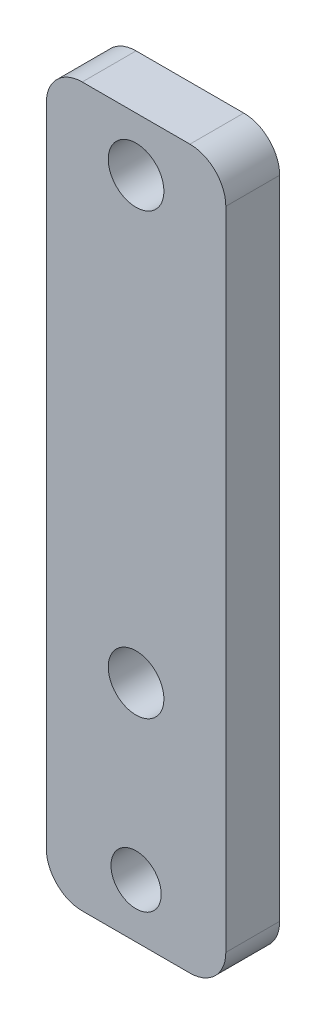
ISO-10303-21;
HEADER;
FILE_DESCRIPTION(('STEP AP214'),'2;1');
FILE_NAME('part.step','',(''),(''),'','','');
FILE_SCHEMA(('AUTOMOTIVE_DESIGN { 1 0 10303 214 1 1 1 1 }'));
ENDSEC;
DATA;
#1=APPLICATION_CONTEXT('core data for automotive mechanical design processes');
#2=APPLICATION_PROTOCOL_DEFINITION('international standard','automotive_design',2000,#1);
#3=PRODUCT_CONTEXT('',#1,'mechanical');
#4=PRODUCT('Part','Part','',(#3));
#5=PRODUCT_RELATED_PRODUCT_CATEGORY('part','',(#4));
#6=PRODUCT_DEFINITION_FORMATION('','',#4);
#7=PRODUCT_DEFINITION_CONTEXT('part definition',#1,'design');
#8=PRODUCT_DEFINITION('design','',#6,#7);
#9=PRODUCT_DEFINITION_SHAPE('','',#8);
#10=(LENGTH_UNIT() NAMED_UNIT(*) SI_UNIT(.MILLI.,.METRE.));
#11=(NAMED_UNIT(*) PLANE_ANGLE_UNIT() SI_UNIT($,.RADIAN.));
#12=(NAMED_UNIT(*) SI_UNIT($,.STERADIAN.) SOLID_ANGLE_UNIT());
#13=UNCERTAINTY_MEASURE_WITH_UNIT(LENGTH_MEASURE(1.E-05),#10,'distance_accuracy_value','');
#14=(GEOMETRIC_REPRESENTATION_CONTEXT(3) GLOBAL_UNCERTAINTY_ASSIGNED_CONTEXT((#13)) GLOBAL_UNIT_ASSIGNED_CONTEXT((#10,
#11,#12)) REPRESENTATION_CONTEXT('',''));
#15=CARTESIAN_POINT('',(0.,0.,0.));
#16=DIRECTION('',(0.,0.,1.));
#17=DIRECTION('',(1.,0.,0.));
#18=AXIS2_PLACEMENT_3D('',#15,#16,#17);
#19=CARTESIAN_POINT('',(0.,0.,3.));
#20=DIRECTION('',(0.,0.,-1.));
#21=DIRECTION('',(-1.,0.,0.));
#22=AXIS2_PLACEMENT_3D('',#19,#20,#21);
#23=PLANE('',#22);
#24=DIRECTION('',(0.,-1.,0.));
#25=VECTOR('',#24,1.);
#26=CARTESIAN_POINT('',(-5.,-15.,3.));
#27=LINE('',#26,#25);
#28=CARTESIAN_POINT('',(-5.,13.,3.));
#29=VERTEX_POINT('',#28);
#30=CARTESIAN_POINT('',(-5.,-23.,3.));
#31=VERTEX_POINT('',#30);
#32=EDGE_CURVE('E117',#29,#31,#27,.T.);
#33=ORIENTED_EDGE('',*,*,#32,.T.);
#34=CARTESIAN_POINT('',(-3.,-23.,3.));
#35=DIRECTION('',(0.,0.,-1.));
#36=DIRECTION('',(-1.,0.,0.));
#37=AXIS2_PLACEMENT_3D('',#34,#35,#36);
#38=CIRCLE('',#37,2.);
#39=CARTESIAN_POINT('',(-3.,-25.,3.));
#40=VERTEX_POINT('',#39);
#41=EDGE_CURVE('E142',#31,#40,#38,.F.);
#42=ORIENTED_EDGE('',*,*,#41,.T.);
#43=DIRECTION('',(1.,0.,0.));
#44=VECTOR('',#43,1.);
#45=CARTESIAN_POINT('',(-5.,-25.,3.));
#46=LINE('',#45,#44);
#47=CARTESIAN_POINT('',(3.,-25.,3.));
#48=VERTEX_POINT('',#47);
#49=EDGE_CURVE('E181',#40,#48,#46,.T.);
#50=ORIENTED_EDGE('',*,*,#49,.T.);
#51=CARTESIAN_POINT('',(3.,-23.,3.));
#52=DIRECTION('',(0.,0.,-1.));
#53=DIRECTION('',(-1.,0.,0.));
#54=AXIS2_PLACEMENT_3D('',#51,#52,#53);
#55=CIRCLE('',#54,2.);
#56=CARTESIAN_POINT('',(5.,-23.,3.));
#57=VERTEX_POINT('',#56);
#58=EDGE_CURVE('E140',#48,#57,#55,.F.);
#59=ORIENTED_EDGE('',*,*,#58,.T.);
#60=DIRECTION('',(0.,1.,0.));
#61=VECTOR('',#60,1.);
#62=CARTESIAN_POINT('',(5.,-15.,3.));
#63=LINE('',#62,#61);
#64=CARTESIAN_POINT('',(5.,13.,3.));
#65=VERTEX_POINT('',#64);
#66=EDGE_CURVE('E125',#57,#65,#63,.T.);
#67=ORIENTED_EDGE('',*,*,#66,.T.);
#68=CARTESIAN_POINT('',(3.,13.,3.));
#69=DIRECTION('',(0.,0.,-1.));
#70=DIRECTION('',(-1.,0.,0.));
#71=AXIS2_PLACEMENT_3D('',#68,#69,#70);
#72=CIRCLE('',#71,2.);
#73=CARTESIAN_POINT('',(3.,15.,3.));
#74=VERTEX_POINT('',#73);
#75=EDGE_CURVE('E136',#65,#74,#72,.F.);
#76=ORIENTED_EDGE('',*,*,#75,.T.);
#77=DIRECTION('',(-1.,0.,0.));
#78=VECTOR('',#77,1.);
#79=CARTESIAN_POINT('',(-5.,15.,3.));
#80=LINE('',#79,#78);
#81=CARTESIAN_POINT('',(-3.,15.,3.));
#82=VERTEX_POINT('',#81);
#83=EDGE_CURVE('E129',#74,#82,#80,.T.);
#84=ORIENTED_EDGE('',*,*,#83,.T.);
#85=CARTESIAN_POINT('',(-3.,13.,3.));
#86=DIRECTION('',(0.,0.,-1.));
#87=DIRECTION('',(-1.,0.,0.));
#88=AXIS2_PLACEMENT_3D('',#85,#86,#87);
#89=CIRCLE('',#88,2.);
#90=EDGE_CURVE('E138',#82,#29,#89,.F.);
#91=ORIENTED_EDGE('',*,*,#90,.T.);
#92=EDGE_LOOP('',(#33,#42,#50,#59,#67,#76,#84,#91));
#93=FACE_BOUND('',#92,.T.);
#94=CARTESIAN_POINT('',(0.,12.,3.));
#95=DIRECTION('',(0.,0.,1.));
#96=DIRECTION('',(1.,0.,0.));
#97=AXIS2_PLACEMENT_3D('',#94,#95,#96);
#98=CIRCLE('',#97,1.55);
#99=CARTESIAN_POINT('',(1.55,12.,3.));
#100=VERTEX_POINT('',#99);
#101=EDGE_CURVE('E167',#100,#100,#98,.T.);
#102=ORIENTED_EDGE('',*,*,#101,.F.);
#103=EDGE_LOOP('',(#102));
#104=FACE_BOUND('',#103,.T.);
#105=CARTESIAN_POINT('',(0.,-12.5,3.));
#106=DIRECTION('',(0.,0.,1.));
#107=DIRECTION('',(1.,0.,0.));
#108=AXIS2_PLACEMENT_3D('',#105,#106,#107);
#109=CIRCLE('',#108,1.55);
#110=CARTESIAN_POINT('',(1.55,-12.5,3.));
#111=VERTEX_POINT('',#110);
#112=EDGE_CURVE('E184',#111,#111,#109,.T.);
#113=ORIENTED_EDGE('',*,*,#112,.F.);
#114=EDGE_LOOP('',(#113));
#115=FACE_BOUND('',#114,.T.);
#116=CARTESIAN_POINT('',(0.,-22.,3.));
#117=DIRECTION('',(0.,0.,1.));
#118=DIRECTION('',(1.,0.,0.));
#119=AXIS2_PLACEMENT_3D('',#116,#117,#118);
#120=CIRCLE('',#119,1.4);
#121=CARTESIAN_POINT('',(1.4,-22.,3.));
#122=VERTEX_POINT('',#121);
#123=EDGE_CURVE('E189',#122,#122,#120,.T.);
#124=ORIENTED_EDGE('',*,*,#123,.F.);
#125=EDGE_LOOP('',(#124));
#126=FACE_BOUND('',#125,.T.);
#127=ADVANCED_FACE('F37',(#93,#104,#115,#126),#23,.F.);
#128=CARTESIAN_POINT('',(0.,0.,0.));
#129=DIRECTION('',(0.,0.,-1.));
#130=DIRECTION('',(-1.,0.,0.));
#131=AXIS2_PLACEMENT_3D('',#128,#129,#130);
#132=PLANE('',#131);
#133=CARTESIAN_POINT('',(0.,12.,0.));
#134=DIRECTION('',(0.,0.,1.));
#135=DIRECTION('',(1.,0.,0.));
#136=AXIS2_PLACEMENT_3D('',#133,#134,#135);
#137=CIRCLE('',#136,1.55);
#138=CARTESIAN_POINT('',(1.55,12.,0.));
#139=VERTEX_POINT('',#138);
#140=EDGE_CURVE('E193',#139,#139,#137,.T.);
#141=ORIENTED_EDGE('',*,*,#140,.T.);
#142=EDGE_LOOP('',(#141));
#143=FACE_BOUND('',#142,.T.);
#144=DIRECTION('',(1.,0.,0.));
#145=VECTOR('',#144,1.);
#146=CARTESIAN_POINT('',(-5.,-25.,0.));
#147=LINE('',#146,#145);
#148=CARTESIAN_POINT('',(-3.,-25.,0.));
#149=VERTEX_POINT('',#148);
#150=CARTESIAN_POINT('',(3.,-25.,0.));
#151=VERTEX_POINT('',#150);
#152=EDGE_CURVE('E175',#149,#151,#147,.T.);
#153=ORIENTED_EDGE('',*,*,#152,.F.);
#154=CARTESIAN_POINT('',(-3.,-23.,0.));
#155=DIRECTION('',(0.,0.,-1.));
#156=DIRECTION('',(-1.,0.,0.));
#157=AXIS2_PLACEMENT_3D('',#154,#155,#156);
#158=CIRCLE('',#157,2.);
#159=CARTESIAN_POINT('',(-5.,-23.,0.));
#160=VERTEX_POINT('',#159);
#161=EDGE_CURVE('E124',#149,#160,#158,.T.);
#162=ORIENTED_EDGE('',*,*,#161,.T.);
#163=DIRECTION('',(0.,-1.,0.));
#164=VECTOR('',#163,1.);
#165=CARTESIAN_POINT('',(-5.,-15.,0.));
#166=LINE('',#165,#164);
#167=CARTESIAN_POINT('',(-5.,13.,0.));
#168=VERTEX_POINT('',#167);
#169=EDGE_CURVE('E114',#168,#160,#166,.T.);
#170=ORIENTED_EDGE('',*,*,#169,.F.);
#171=CARTESIAN_POINT('',(-3.,13.,0.));
#172=DIRECTION('',(0.,0.,-1.));
#173=DIRECTION('',(-1.,0.,0.));
#174=AXIS2_PLACEMENT_3D('',#171,#172,#173);
#175=CIRCLE('',#174,2.);
#176=CARTESIAN_POINT('',(-3.,15.,0.));
#177=VERTEX_POINT('',#176);
#178=EDGE_CURVE('E52',#168,#177,#175,.T.);
#179=ORIENTED_EDGE('',*,*,#178,.T.);
#180=DIRECTION('',(-1.,0.,0.));
#181=VECTOR('',#180,1.);
#182=CARTESIAN_POINT('',(-5.,15.,0.));
#183=LINE('',#182,#181);
#184=CARTESIAN_POINT('',(3.,15.,0.));
#185=VERTEX_POINT('',#184);
#186=EDGE_CURVE('E126',#185,#177,#183,.T.);
#187=ORIENTED_EDGE('',*,*,#186,.F.);
#188=CARTESIAN_POINT('',(3.,13.,0.));
#189=DIRECTION('',(0.,0.,-1.));
#190=DIRECTION('',(-1.,0.,0.));
#191=AXIS2_PLACEMENT_3D('',#188,#189,#190);
#192=CIRCLE('',#191,2.);
#193=CARTESIAN_POINT('',(5.,13.,0.));
#194=VERTEX_POINT('',#193);
#195=EDGE_CURVE('E60',#185,#194,#192,.T.);
#196=ORIENTED_EDGE('',*,*,#195,.T.);
#197=DIRECTION('',(0.,1.,0.));
#198=VECTOR('',#197,1.);
#199=CARTESIAN_POINT('',(5.,-15.,0.));
#200=LINE('',#199,#198);
#201=CARTESIAN_POINT('',(5.,-23.,0.));
#202=VERTEX_POINT('',#201);
#203=EDGE_CURVE('E131',#202,#194,#200,.T.);
#204=ORIENTED_EDGE('',*,*,#203,.F.);
#205=CARTESIAN_POINT('',(3.,-23.,0.));
#206=DIRECTION('',(0.,0.,-1.));
#207=DIRECTION('',(-1.,0.,0.));
#208=AXIS2_PLACEMENT_3D('',#205,#206,#207);
#209=CIRCLE('',#208,2.);
#210=EDGE_CURVE('E107',#202,#151,#209,.T.);
#211=ORIENTED_EDGE('',*,*,#210,.T.);
#212=EDGE_LOOP('',(#153,#162,#170,#179,#187,#196,#204,#211));
#213=FACE_BOUND('',#212,.T.);
#214=CARTESIAN_POINT('',(0.,-12.5,0.));
#215=DIRECTION('',(0.,0.,1.));
#216=DIRECTION('',(1.,0.,0.));
#217=AXIS2_PLACEMENT_3D('',#214,#215,#216);
#218=CIRCLE('',#217,1.55);
#219=CARTESIAN_POINT('',(1.55,-12.5,0.));
#220=VERTEX_POINT('',#219);
#221=EDGE_CURVE('E180',#220,#220,#218,.T.);
#222=ORIENTED_EDGE('',*,*,#221,.T.);
#223=EDGE_LOOP('',(#222));
#224=FACE_BOUND('',#223,.T.);
#225=CARTESIAN_POINT('',(0.,-22.,0.));
#226=DIRECTION('',(0.,0.,1.));
#227=DIRECTION('',(1.,0.,0.));
#228=AXIS2_PLACEMENT_3D('',#225,#226,#227);
#229=CIRCLE('',#228,1.4);
#230=CARTESIAN_POINT('',(1.4,-22.,0.));
#231=VERTEX_POINT('',#230);
#232=EDGE_CURVE('E186',#231,#231,#229,.T.);
#233=ORIENTED_EDGE('',*,*,#232,.T.);
#234=EDGE_LOOP('',(#233));
#235=FACE_BOUND('',#234,.T.);
#236=ADVANCED_FACE('F121',(#143,#213,#224,#235),#132,.T.);
#237=CARTESIAN_POINT('',(5.,-15.,3.));
#238=DIRECTION('',(-1.,0.,0.));
#239=DIRECTION('',(0.,0.,1.));
#240=AXIS2_PLACEMENT_3D('',#237,#238,#239);
#241=PLANE('',#240);
#242=ORIENTED_EDGE('',*,*,#66,.F.);
#243=DIRECTION('',(0.,0.,1.));
#244=VECTOR('',#243,1.);
#245=CARTESIAN_POINT('',(5.,-23.,0.));
#246=LINE('',#245,#244);
#247=EDGE_CURVE('E154',#57,#202,#246,.F.);
#248=ORIENTED_EDGE('',*,*,#247,.T.);
#249=ORIENTED_EDGE('',*,*,#203,.T.);
#250=DIRECTION('',(0.,0.,-1.));
#251=VECTOR('',#250,1.);
#252=CARTESIAN_POINT('',(5.,13.,3.));
#253=LINE('',#252,#251);
#254=EDGE_CURVE('E152',#194,#65,#253,.F.);
#255=ORIENTED_EDGE('',*,*,#254,.T.);
#256=EDGE_LOOP('',(#242,#248,#249,#255));
#257=FACE_BOUND('',#256,.T.);
#258=ADVANCED_FACE('F165',(#257),#241,.F.);
#259=CARTESIAN_POINT('',(-5.,15.,3.));
#260=DIRECTION('',(0.,-1.,0.));
#261=DIRECTION('',(0.,0.,-1.));
#262=AXIS2_PLACEMENT_3D('',#259,#260,#261);
#263=PLANE('',#262);
#264=ORIENTED_EDGE('',*,*,#186,.T.);
#265=DIRECTION('',(0.,0.,-1.));
#266=VECTOR('',#265,1.);
#267=CARTESIAN_POINT('',(-3.,15.,3.));
#268=LINE('',#267,#266);
#269=EDGE_CURVE('E11',#177,#82,#268,.F.);
#270=ORIENTED_EDGE('',*,*,#269,.T.);
#271=ORIENTED_EDGE('',*,*,#83,.F.);
#272=DIRECTION('',(0.,0.,-1.));
#273=VECTOR('',#272,1.);
#274=CARTESIAN_POINT('',(3.,15.,3.));
#275=LINE('',#274,#273);
#276=EDGE_CURVE('E45',#74,#185,#275,.T.);
#277=ORIENTED_EDGE('',*,*,#276,.T.);
#278=EDGE_LOOP('',(#264,#270,#271,#277));
#279=FACE_BOUND('',#278,.T.);
#280=ADVANCED_FACE('F157',(#279),#263,.F.);
#281=CARTESIAN_POINT('',(-5.,-15.,3.));
#282=DIRECTION('',(1.,0.,0.));
#283=DIRECTION('',(0.,0.,-1.));
#284=AXIS2_PLACEMENT_3D('',#281,#282,#283);
#285=PLANE('',#284);
#286=ORIENTED_EDGE('',*,*,#169,.T.);
#287=DIRECTION('',(0.,0.,1.));
#288=VECTOR('',#287,1.);
#289=CARTESIAN_POINT('',(-5.,-23.,3.));
#290=LINE('',#289,#288);
#291=EDGE_CURVE('E118',#160,#31,#290,.T.);
#292=ORIENTED_EDGE('',*,*,#291,.T.);
#293=ORIENTED_EDGE('',*,*,#32,.F.);
#294=DIRECTION('',(0.,0.,-1.));
#295=VECTOR('',#294,1.);
#296=CARTESIAN_POINT('',(-5.,13.,3.));
#297=LINE('',#296,#295);
#298=EDGE_CURVE('E106',#29,#168,#297,.T.);
#299=ORIENTED_EDGE('',*,*,#298,.T.);
#300=EDGE_LOOP('',(#286,#292,#293,#299));
#301=FACE_BOUND('',#300,.T.);
#302=ADVANCED_FACE('F112',(#301),#285,.F.);
#303=CARTESIAN_POINT('',(0.,12.,3.));
#304=DIRECTION('',(0.,0.,-1.));
#305=DIRECTION('',(-1.,0.,0.));
#306=AXIS2_PLACEMENT_3D('',#303,#304,#305);
#307=CYLINDRICAL_SURFACE('',#306,1.55);
#308=ORIENTED_EDGE('',*,*,#101,.T.);
#309=EDGE_LOOP('',(#308));
#310=FACE_BOUND('',#309,.T.);
#311=ORIENTED_EDGE('',*,*,#140,.F.);
#312=EDGE_LOOP('',(#311));
#313=FACE_BOUND('',#312,.T.);
#314=ADVANCED_FACE('F221',(#310,#313),#307,.F.);
#315=CARTESIAN_POINT('',(0.,-12.5,3.));
#316=DIRECTION('',(0.,0.,-1.));
#317=DIRECTION('',(-1.,0.,0.));
#318=AXIS2_PLACEMENT_3D('',#315,#316,#317);
#319=CYLINDRICAL_SURFACE('',#318,1.55);
#320=ORIENTED_EDGE('',*,*,#112,.T.);
#321=EDGE_LOOP('',(#320));
#322=FACE_BOUND('',#321,.T.);
#323=ORIENTED_EDGE('',*,*,#221,.F.);
#324=EDGE_LOOP('',(#323));
#325=FACE_BOUND('',#324,.T.);
#326=ADVANCED_FACE('F247',(#322,#325),#319,.F.);
#327=CARTESIAN_POINT('',(-5.,-25.,0.));
#328=DIRECTION('',(0.,-1.,0.));
#329=DIRECTION('',(0.,0.,-1.));
#330=AXIS2_PLACEMENT_3D('',#327,#328,#329);
#331=PLANE('',#330);
#332=ORIENTED_EDGE('',*,*,#49,.F.);
#333=DIRECTION('',(0.,0.,1.));
#334=VECTOR('',#333,1.);
#335=CARTESIAN_POINT('',(-3.,-25.,0.));
#336=LINE('',#335,#334);
#337=EDGE_CURVE('E147',#40,#149,#336,.F.);
#338=ORIENTED_EDGE('',*,*,#337,.T.);
#339=ORIENTED_EDGE('',*,*,#152,.T.);
#340=DIRECTION('',(0.,0.,1.));
#341=VECTOR('',#340,1.);
#342=CARTESIAN_POINT('',(3.,-25.,3.));
#343=LINE('',#342,#341);
#344=EDGE_CURVE('E144',#151,#48,#343,.T.);
#345=ORIENTED_EDGE('',*,*,#344,.T.);
#346=EDGE_LOOP('',(#332,#338,#339,#345));
#347=FACE_BOUND('',#346,.T.);
#348=ADVANCED_FACE('F178',(#347),#331,.T.);
#349=CARTESIAN_POINT('',(0.,-22.,0.));
#350=DIRECTION('',(0.,0.,1.));
#351=DIRECTION('',(1.,0.,0.));
#352=AXIS2_PLACEMENT_3D('',#349,#350,#351);
#353=CYLINDRICAL_SURFACE('',#352,1.4);
#354=ORIENTED_EDGE('',*,*,#232,.F.);
#355=EDGE_LOOP('',(#354));
#356=FACE_BOUND('',#355,.T.);
#357=ORIENTED_EDGE('',*,*,#123,.T.);
#358=EDGE_LOOP('',(#357));
#359=FACE_BOUND('',#358,.T.);
#360=ADVANCED_FACE('F203',(#356,#359),#353,.F.);
#361=CARTESIAN_POINT('',(-3.,-23.,3.));
#362=DIRECTION('',(0.,0.,-1.));
#363=DIRECTION('',(-1.,0.,0.));
#364=AXIS2_PLACEMENT_3D('',#361,#362,#363);
#365=CYLINDRICAL_SURFACE('',#364,2.);
#366=ORIENTED_EDGE('',*,*,#161,.F.);
#367=ORIENTED_EDGE('',*,*,#337,.F.);
#368=ORIENTED_EDGE('',*,*,#41,.F.);
#369=ORIENTED_EDGE('',*,*,#291,.F.);
#370=EDGE_LOOP('',(#366,#367,#368,#369));
#371=FACE_BOUND('',#370,.T.);
#372=ADVANCED_FACE('F201',(#371),#365,.T.);
#373=CARTESIAN_POINT('',(3.,-23.,0.));
#374=DIRECTION('',(0.,0.,-1.));
#375=DIRECTION('',(-1.,0.,0.));
#376=AXIS2_PLACEMENT_3D('',#373,#374,#375);
#377=CYLINDRICAL_SURFACE('',#376,2.);
#378=ORIENTED_EDGE('',*,*,#210,.F.);
#379=ORIENTED_EDGE('',*,*,#247,.F.);
#380=ORIENTED_EDGE('',*,*,#58,.F.);
#381=ORIENTED_EDGE('',*,*,#344,.F.);
#382=EDGE_LOOP('',(#378,#379,#380,#381));
#383=FACE_BOUND('',#382,.T.);
#384=ADVANCED_FACE('F172',(#383),#377,.T.);
#385=CARTESIAN_POINT('',(-3.,13.,3.));
#386=DIRECTION('',(0.,0.,-1.));
#387=DIRECTION('',(-1.,0.,0.));
#388=AXIS2_PLACEMENT_3D('',#385,#386,#387);
#389=CYLINDRICAL_SURFACE('',#388,2.);
#390=ORIENTED_EDGE('',*,*,#90,.F.);
#391=ORIENTED_EDGE('',*,*,#269,.F.);
#392=ORIENTED_EDGE('',*,*,#178,.F.);
#393=ORIENTED_EDGE('',*,*,#298,.F.);
#394=EDGE_LOOP('',(#390,#391,#392,#393));
#395=FACE_BOUND('',#394,.T.);
#396=ADVANCED_FACE('F105',(#395),#389,.T.);
#397=CARTESIAN_POINT('',(3.,13.,3.));
#398=DIRECTION('',(0.,0.,-1.));
#399=DIRECTION('',(-1.,0.,0.));
#400=AXIS2_PLACEMENT_3D('',#397,#398,#399);
#401=CYLINDRICAL_SURFACE('',#400,2.);
#402=ORIENTED_EDGE('',*,*,#75,.F.);
#403=ORIENTED_EDGE('',*,*,#254,.F.);
#404=ORIENTED_EDGE('',*,*,#195,.F.);
#405=ORIENTED_EDGE('',*,*,#276,.F.);
#406=EDGE_LOOP('',(#402,#403,#404,#405));
#407=FACE_BOUND('',#406,.T.);
#408=ADVANCED_FACE('F39',(#407),#401,.T.);
#409=CLOSED_SHELL('',(#127,#236,#258,#280,#302,#314,#326,#348,#360,#372,#384,#396,#408));
#410=MANIFOLD_SOLID_BREP('B2',#409);
#411=ADVANCED_BREP_SHAPE_REPRESENTATION('',(#18,#410),#14);
#412=SHAPE_DEFINITION_REPRESENTATION(#9,#411);
ENDSEC;
END-ISO-10303-21;
